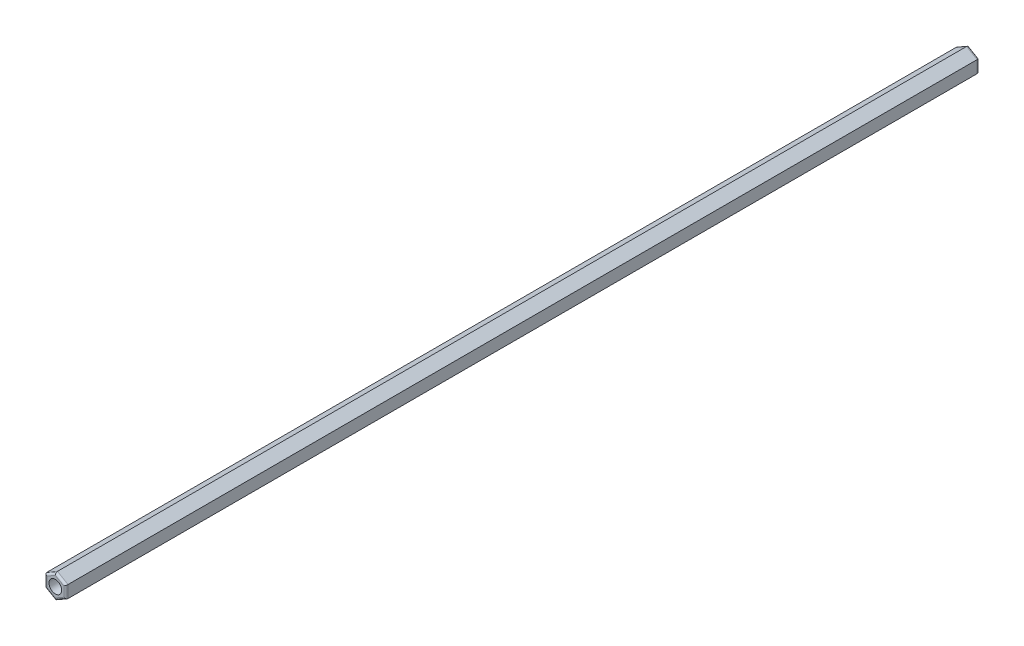
ISO-10303-21;
HEADER;
FILE_DESCRIPTION(('STEP AP214'),'2;1');
FILE_NAME('part.step','',(''),(''),'','','');
FILE_SCHEMA(('AUTOMOTIVE_DESIGN { 1 0 10303 214 1 1 1 1 }'));
ENDSEC;
DATA;
#1=APPLICATION_CONTEXT('core data for automotive mechanical design processes');
#2=APPLICATION_PROTOCOL_DEFINITION('international standard','automotive_design',2000,#1);
#3=PRODUCT_CONTEXT('',#1,'mechanical');
#4=PRODUCT('Part','Part','',(#3));
#5=PRODUCT_RELATED_PRODUCT_CATEGORY('part','',(#4));
#6=PRODUCT_DEFINITION_FORMATION('','',#4);
#7=PRODUCT_DEFINITION_CONTEXT('part definition',#1,'design');
#8=PRODUCT_DEFINITION('design','',#6,#7);
#9=PRODUCT_DEFINITION_SHAPE('','',#8);
#10=(LENGTH_UNIT() NAMED_UNIT(*) SI_UNIT(.MILLI.,.METRE.));
#11=(NAMED_UNIT(*) PLANE_ANGLE_UNIT() SI_UNIT($,.RADIAN.));
#12=(NAMED_UNIT(*) SI_UNIT($,.STERADIAN.) SOLID_ANGLE_UNIT());
#13=UNCERTAINTY_MEASURE_WITH_UNIT(LENGTH_MEASURE(1.E-05),#10,'distance_accuracy_value','');
#14=(GEOMETRIC_REPRESENTATION_CONTEXT(3) GLOBAL_UNCERTAINTY_ASSIGNED_CONTEXT((#13)) GLOBAL_UNIT_ASSIGNED_CONTEXT((#10,
#11,#12)) REPRESENTATION_CONTEXT('',''));
#15=CARTESIAN_POINT('',(0.,0.,0.));
#16=DIRECTION('',(0.,0.,1.));
#17=DIRECTION('',(1.,0.,0.));
#18=AXIS2_PLACEMENT_3D('',#15,#16,#17);
#19=CARTESIAN_POINT('',(-67.50212267549,1.44337567297406,216.));
#20=DIRECTION('',(1.,0.,0.));
#21=DIRECTION('',(0.,0.,-1.));
#22=AXIS2_PLACEMENT_3D('',#19,#20,#21);
#23=PLANE('',#22);
#24=DIRECTION('',(0.,0.,-1.));
#25=VECTOR('',#24,1.);
#26=CARTESIAN_POINT('',(-67.50212267549,-1.44337567297407,216.));
#27=LINE('',#26,#25);
#28=CARTESIAN_POINT('',(-67.50212267549,-1.44337567297407,215.5));
#29=VERTEX_POINT('',#28);
#30=CARTESIAN_POINT('',(-67.50212267549,-1.44337567297407,0.5));
#31=VERTEX_POINT('',#30);
#32=EDGE_CURVE('E153',#29,#31,#27,.T.);
#33=ORIENTED_EDGE('',*,*,#32,.T.);
#34=DIRECTION('',(0.,-1.,0.));
#35=VECTOR('',#34,1.);
#36=CARTESIAN_POINT('',(-67.50212267549,1.44337567297406,0.5));
#37=LINE('',#36,#35);
#38=CARTESIAN_POINT('',(-67.50212267549,1.44337567297406,0.5));
#39=VERTEX_POINT('',#38);
#40=EDGE_CURVE('E150',#31,#39,#37,.F.);
#41=ORIENTED_EDGE('',*,*,#40,.T.);
#42=DIRECTION('',(0.,0.,-1.));
#43=VECTOR('',#42,1.);
#44=CARTESIAN_POINT('',(-67.50212267549,1.44337567297406,216.));
#45=LINE('',#44,#43);
#46=CARTESIAN_POINT('',(-67.50212267549,1.44337567297406,215.5));
#47=VERTEX_POINT('',#46);
#48=EDGE_CURVE('E147',#47,#39,#45,.T.);
#49=ORIENTED_EDGE('',*,*,#48,.F.);
#50=DIRECTION('',(0.,-1.,0.));
#51=VECTOR('',#50,1.);
#52=CARTESIAN_POINT('',(-67.50212267549,-1.44337567297407,215.5));
#53=LINE('',#52,#51);
#54=EDGE_CURVE('E207',#47,#29,#53,.T.);
#55=ORIENTED_EDGE('',*,*,#54,.T.);
#56=EDGE_LOOP('',(#33,#41,#49,#55));
#57=FACE_BOUND('',#56,.T.);
#58=ADVANCED_FACE('F33',(#57),#23,.T.);
#59=CARTESIAN_POINT('',(-70.00212267549,2.88675134594811,216.));
#60=DIRECTION('',(0.5,0.866025403784439,0.));
#61=DIRECTION('',(-0.866025403784439,0.5,0.));
#62=AXIS2_PLACEMENT_3D('',#59,#60,#61);
#63=PLANE('',#62);
#64=ORIENTED_EDGE('',*,*,#48,.T.);
#65=DIRECTION('',(0.866025403784439,-0.5,0.));
#66=VECTOR('',#65,1.);
#67=CARTESIAN_POINT('',(-70.00212267549,2.88675134594811,0.5));
#68=LINE('',#67,#66);
#69=CARTESIAN_POINT('',(-70.00212267549,2.88675134594811,0.5));
#70=VERTEX_POINT('',#69);
#71=EDGE_CURVE('E192',#39,#70,#68,.F.);
#72=ORIENTED_EDGE('',*,*,#71,.T.);
#73=DIRECTION('',(0.,0.,-1.));
#74=VECTOR('',#73,1.);
#75=CARTESIAN_POINT('',(-70.00212267549,2.88675134594811,216.));
#76=LINE('',#75,#74);
#77=CARTESIAN_POINT('',(-70.00212267549,2.88675134594811,215.5));
#78=VERTEX_POINT('',#77);
#79=EDGE_CURVE('E256',#78,#70,#76,.T.);
#80=ORIENTED_EDGE('',*,*,#79,.F.);
#81=DIRECTION('',(0.866025403784439,-0.5,0.));
#82=VECTOR('',#81,1.);
#83=CARTESIAN_POINT('',(-67.50212267549,1.44337567297406,215.5));
#84=LINE('',#83,#82);
#85=EDGE_CURVE('E198',#78,#47,#84,.T.);
#86=ORIENTED_EDGE('',*,*,#85,.T.);
#87=EDGE_LOOP('',(#64,#72,#80,#86));
#88=FACE_BOUND('',#87,.T.);
#89=ADVANCED_FACE('F285',(#88),#63,.T.);
#90=CARTESIAN_POINT('',(-72.50212267549,1.44337567297405,216.));
#91=DIRECTION('',(-0.5,0.866025403784438,0.));
#92=DIRECTION('',(-0.866025403784439,-0.5,0.));
#93=AXIS2_PLACEMENT_3D('',#90,#91,#92);
#94=PLANE('',#93);
#95=ORIENTED_EDGE('',*,*,#79,.T.);
#96=DIRECTION('',(0.866025403784439,0.5,0.));
#97=VECTOR('',#96,1.);
#98=CARTESIAN_POINT('',(-72.50212267549,1.44337567297405,0.5));
#99=LINE('',#98,#97);
#100=CARTESIAN_POINT('',(-72.50212267549,1.44337567297405,0.5));
#101=VERTEX_POINT('',#100);
#102=EDGE_CURVE('E232',#70,#101,#99,.F.);
#103=ORIENTED_EDGE('',*,*,#102,.T.);
#104=DIRECTION('',(0.,0.,-1.));
#105=VECTOR('',#104,1.);
#106=CARTESIAN_POINT('',(-72.50212267549,1.44337567297405,216.));
#107=LINE('',#106,#105);
#108=CARTESIAN_POINT('',(-72.50212267549,1.44337567297405,215.5));
#109=VERTEX_POINT('',#108);
#110=EDGE_CURVE('E254',#109,#101,#107,.T.);
#111=ORIENTED_EDGE('',*,*,#110,.F.);
#112=DIRECTION('',(0.866025403784439,0.5,0.));
#113=VECTOR('',#112,1.);
#114=CARTESIAN_POINT('',(-70.00212267549,2.88675134594811,215.5));
#115=LINE('',#114,#113);
#116=EDGE_CURVE('E235',#109,#78,#115,.T.);
#117=ORIENTED_EDGE('',*,*,#116,.T.);
#118=EDGE_LOOP('',(#95,#103,#111,#117));
#119=FACE_BOUND('',#118,.T.);
#120=ADVANCED_FACE('F291',(#119),#94,.T.);
#121=CARTESIAN_POINT('',(-72.50212267549,-1.44337567297407,216.));
#122=DIRECTION('',(-1.,0.,0.));
#123=DIRECTION('',(0.,0.,1.));
#124=AXIS2_PLACEMENT_3D('',#121,#122,#123);
#125=PLANE('',#124);
#126=ORIENTED_EDGE('',*,*,#110,.T.);
#127=DIRECTION('',(0.,1.,0.));
#128=VECTOR('',#127,1.);
#129=CARTESIAN_POINT('',(-72.50212267549,-1.44337567297407,0.5));
#130=LINE('',#129,#128);
#131=CARTESIAN_POINT('',(-72.50212267549,-1.44337567297407,0.5));
#132=VERTEX_POINT('',#131);
#133=EDGE_CURVE('E202',#101,#132,#130,.F.);
#134=ORIENTED_EDGE('',*,*,#133,.T.);
#135=DIRECTION('',(0.,0.,-1.));
#136=VECTOR('',#135,1.);
#137=CARTESIAN_POINT('',(-72.50212267549,-1.44337567297407,216.));
#138=LINE('',#137,#136);
#139=CARTESIAN_POINT('',(-72.50212267549,-1.44337567297407,215.5));
#140=VERTEX_POINT('',#139);
#141=EDGE_CURVE('E251',#140,#132,#138,.T.);
#142=ORIENTED_EDGE('',*,*,#141,.F.);
#143=DIRECTION('',(0.,1.,0.));
#144=VECTOR('',#143,1.);
#145=CARTESIAN_POINT('',(-72.50212267549,1.44337567297405,215.5));
#146=LINE('',#145,#144);
#147=EDGE_CURVE('E227',#140,#109,#146,.T.);
#148=ORIENTED_EDGE('',*,*,#147,.T.);
#149=EDGE_LOOP('',(#126,#134,#142,#148));
#150=FACE_BOUND('',#149,.T.);
#151=ADVANCED_FACE('F342',(#150),#125,.T.);
#152=CARTESIAN_POINT('',(-70.00212267549,-2.88675134594813,216.));
#153=DIRECTION('',(-0.499999999999999,-0.866025403784439,0.));
#154=DIRECTION('',(0.866025403784439,-0.499999999999999,0.));
#155=AXIS2_PLACEMENT_3D('',#152,#153,#154);
#156=PLANE('',#155);
#157=ORIENTED_EDGE('',*,*,#141,.T.);
#158=DIRECTION('',(-0.866025403784439,0.499999999999999,0.));
#159=VECTOR('',#158,1.);
#160=CARTESIAN_POINT('',(-70.00212267549,-2.88675134594813,0.5));
#161=LINE('',#160,#159);
#162=CARTESIAN_POINT('',(-70.00212267549,-2.88675134594813,0.5));
#163=VERTEX_POINT('',#162);
#164=EDGE_CURVE('E200',#132,#163,#161,.F.);
#165=ORIENTED_EDGE('',*,*,#164,.T.);
#166=DIRECTION('',(0.,0.,-1.));
#167=VECTOR('',#166,1.);
#168=CARTESIAN_POINT('',(-70.00212267549,-2.88675134594813,216.));
#169=LINE('',#168,#167);
#170=CARTESIAN_POINT('',(-70.00212267549,-2.88675134594813,215.5));
#171=VERTEX_POINT('',#170);
#172=EDGE_CURVE('E248',#171,#163,#169,.T.);
#173=ORIENTED_EDGE('',*,*,#172,.F.);
#174=DIRECTION('',(-0.866025403784439,0.499999999999999,0.));
#175=VECTOR('',#174,1.);
#176=CARTESIAN_POINT('',(-72.50212267549,-1.44337567297407,215.5));
#177=LINE('',#176,#175);
#178=EDGE_CURVE('E197',#171,#140,#177,.T.);
#179=ORIENTED_EDGE('',*,*,#178,.T.);
#180=EDGE_LOOP('',(#157,#165,#173,#179));
#181=FACE_BOUND('',#180,.T.);
#182=ADVANCED_FACE('F281',(#181),#156,.T.);
#183=CARTESIAN_POINT('',(-67.50212267549,-1.44337567297407,216.));
#184=DIRECTION('',(0.500000000000001,-0.866025403784438,0.));
#185=DIRECTION('',(0.866025403784438,0.500000000000001,0.));
#186=AXIS2_PLACEMENT_3D('',#183,#184,#185);
#187=PLANE('',#186);
#188=ORIENTED_EDGE('',*,*,#172,.T.);
#189=DIRECTION('',(-0.866025403784438,-0.500000000000001,0.));
#190=VECTOR('',#189,1.);
#191=CARTESIAN_POINT('',(-67.50212267549,-1.44337567297407,0.5));
#192=LINE('',#191,#190);
#193=EDGE_CURVE('E212',#163,#31,#192,.F.);
#194=ORIENTED_EDGE('',*,*,#193,.T.);
#195=ORIENTED_EDGE('',*,*,#32,.F.);
#196=DIRECTION('',(-0.866025403784438,-0.500000000000001,0.));
#197=VECTOR('',#196,1.);
#198=CARTESIAN_POINT('',(-70.00212267549,-2.88675134594813,215.5));
#199=LINE('',#198,#197);
#200=EDGE_CURVE('E210',#29,#171,#199,.T.);
#201=ORIENTED_EDGE('',*,*,#200,.T.);
#202=EDGE_LOOP('',(#188,#194,#195,#201));
#203=FACE_BOUND('',#202,.T.);
#204=ADVANCED_FACE('F274',(#203),#187,.T.);
#205=CARTESIAN_POINT('',(0.,0.,216.));
#206=DIRECTION('',(0.,0.,-1.));
#207=DIRECTION('',(-1.,0.,0.));
#208=AXIS2_PLACEMENT_3D('',#205,#206,#207);
#209=PLANE('',#208);
#210=CARTESIAN_POINT('',(-70.00212267549,0.,216.));
#211=DIRECTION('',(0.,0.,1.));
#212=DIRECTION('',(1.,0.,0.));
#213=AXIS2_PLACEMENT_3D('',#210,#211,#212);
#214=CIRCLE('',#213,1.5);
#215=CARTESIAN_POINT('',(-68.50212267549,0.,216.));
#216=VERTEX_POINT('',#215);
#217=EDGE_CURVE('E259',#216,#216,#214,.T.);
#218=ORIENTED_EDGE('',*,*,#217,.F.);
#219=EDGE_LOOP('',(#218));
#220=FACE_BOUND('',#219,.T.);
#221=DIRECTION('',(0.866025403784439,-0.5,0.));
#222=VECTOR('',#221,1.);
#223=CARTESIAN_POINT('',(-70.25212267549,2.45373864405589,216.));
#224=LINE('',#223,#222);
#225=CARTESIAN_POINT('',(-68.00212267549,1.15470053837924,216.));
#226=VERTEX_POINT('',#225);
#227=CARTESIAN_POINT('',(-70.00212267549,2.30940107675849,216.));
#228=VERTEX_POINT('',#227);
#229=EDGE_CURVE('E57',#226,#228,#224,.F.);
#230=ORIENTED_EDGE('',*,*,#229,.T.);
#231=DIRECTION('',(0.866025403784439,0.5,0.));
#232=VECTOR('',#231,1.);
#233=CARTESIAN_POINT('',(-72.25212267549,1.01036297108183,216.));
#234=LINE('',#233,#232);
#235=CARTESIAN_POINT('',(-72.00212267549,1.15470053837923,216.));
#236=VERTEX_POINT('',#235);
#237=EDGE_CURVE('E11',#228,#236,#234,.F.);
#238=ORIENTED_EDGE('',*,*,#237,.T.);
#239=DIRECTION('',(0.,1.,0.));
#240=VECTOR('',#239,1.);
#241=CARTESIAN_POINT('',(-72.00212267549,-1.44337567297407,216.));
#242=LINE('',#241,#240);
#243=CARTESIAN_POINT('',(-72.00212267549,-1.15470053837925,216.));
#244=VERTEX_POINT('',#243);
#245=EDGE_CURVE('E42',#236,#244,#242,.F.);
#246=ORIENTED_EDGE('',*,*,#245,.T.);
#247=DIRECTION('',(-0.866025403784439,0.499999999999999,0.));
#248=VECTOR('',#247,1.);
#249=CARTESIAN_POINT('',(-69.75212267549,-2.45373864405591,216.));
#250=LINE('',#249,#248);
#251=CARTESIAN_POINT('',(-70.00212267549,-2.3094010767585,216.));
#252=VERTEX_POINT('',#251);
#253=EDGE_CURVE('E218',#244,#252,#250,.F.);
#254=ORIENTED_EDGE('',*,*,#253,.T.);
#255=DIRECTION('',(-0.866025403784438,-0.500000000000001,0.));
#256=VECTOR('',#255,1.);
#257=CARTESIAN_POINT('',(-67.75212267549,-1.01036297108185,216.));
#258=LINE('',#257,#256);
#259=CARTESIAN_POINT('',(-68.00212267549,-1.15470053837925,216.));
#260=VERTEX_POINT('',#259);
#261=EDGE_CURVE('E214',#252,#260,#258,.F.);
#262=ORIENTED_EDGE('',*,*,#261,.T.);
#263=DIRECTION('',(0.,-1.,0.));
#264=VECTOR('',#263,1.);
#265=CARTESIAN_POINT('',(-68.00212267549,1.44337567297406,216.));
#266=LINE('',#265,#264);
#267=EDGE_CURVE('E216',#260,#226,#266,.F.);
#268=ORIENTED_EDGE('',*,*,#267,.T.);
#269=EDGE_LOOP('',(#230,#238,#246,#254,#262,#268));
#270=FACE_BOUND('',#269,.T.);
#271=ADVANCED_FACE('F220',(#220,#270),#209,.F.);
#272=CARTESIAN_POINT('',(0.,0.,0.));
#273=DIRECTION('',(0.,0.,-1.));
#274=DIRECTION('',(-1.,0.,0.));
#275=AXIS2_PLACEMENT_3D('',#272,#273,#274);
#276=PLANE('',#275);
#277=CARTESIAN_POINT('',(-70.00212267549,0.,0.));
#278=DIRECTION('',(0.,0.,1.));
#279=DIRECTION('',(1.,0.,0.));
#280=AXIS2_PLACEMENT_3D('',#277,#278,#279);
#281=CIRCLE('',#280,1.5);
#282=CARTESIAN_POINT('',(-68.50212267549,0.,0.));
#283=VERTEX_POINT('',#282);
#284=EDGE_CURVE('E162',#283,#283,#281,.T.);
#285=ORIENTED_EDGE('',*,*,#284,.T.);
#286=EDGE_LOOP('',(#285));
#287=FACE_BOUND('',#286,.T.);
#288=DIRECTION('',(0.,1.,0.));
#289=VECTOR('',#288,1.);
#290=CARTESIAN_POINT('',(-72.00212267549,0.,0.));
#291=LINE('',#290,#289);
#292=CARTESIAN_POINT('',(-72.00212267549,-1.15470053837926,0.));
#293=VERTEX_POINT('',#292);
#294=CARTESIAN_POINT('',(-72.00212267549,1.15470053837924,0.));
#295=VERTEX_POINT('',#294);
#296=EDGE_CURVE('E242',#293,#295,#291,.T.);
#297=ORIENTED_EDGE('',*,*,#296,.T.);
#298=DIRECTION('',(0.866025403784439,0.5,0.));
#299=VECTOR('',#298,1.);
#300=CARTESIAN_POINT('',(-18.5005306688725,32.0438590854734,0.));
#301=LINE('',#300,#299);
#302=CARTESIAN_POINT('',(-70.00212267549,2.30940107675849,0.));
#303=VERTEX_POINT('',#302);
#304=EDGE_CURVE('E240',#295,#303,#301,.T.);
#305=ORIENTED_EDGE('',*,*,#304,.T.);
#306=DIRECTION('',(0.866025403784439,-0.5,0.));
#307=VECTOR('',#306,1.);
#308=CARTESIAN_POINT('',(-16.5005306688725,-28.5797574703356,0.));
#309=LINE('',#308,#307);
#310=CARTESIAN_POINT('',(-68.00212267549,1.15470053837924,0.));
#311=VERTEX_POINT('',#310);
#312=EDGE_CURVE('E131',#303,#311,#309,.T.);
#313=ORIENTED_EDGE('',*,*,#312,.T.);
#314=DIRECTION('',(0.,-1.,0.));
#315=VECTOR('',#314,1.);
#316=CARTESIAN_POINT('',(-68.00212267549,0.,0.));
#317=LINE('',#316,#315);
#318=CARTESIAN_POINT('',(-68.00212267549,-1.15470053837925,0.));
#319=VERTEX_POINT('',#318);
#320=EDGE_CURVE('E124',#311,#319,#317,.T.);
#321=ORIENTED_EDGE('',*,*,#320,.T.);
#322=DIRECTION('',(-0.866025403784438,-0.500000000000001,0.));
#323=VECTOR('',#322,1.);
#324=CARTESIAN_POINT('',(-16.5005306688726,28.5797574703357,0.));
#325=LINE('',#324,#323);
#326=CARTESIAN_POINT('',(-70.00212267549,-2.30940107675851,0.));
#327=VERTEX_POINT('',#326);
#328=EDGE_CURVE('E127',#319,#327,#325,.T.);
#329=ORIENTED_EDGE('',*,*,#328,.T.);
#330=DIRECTION('',(-0.866025403784439,0.499999999999999,0.));
#331=VECTOR('',#330,1.);
#332=CARTESIAN_POINT('',(-18.5005306688724,-32.0438590854734,0.));
#333=LINE('',#332,#331);
#334=EDGE_CURVE('E136',#327,#293,#333,.T.);
#335=ORIENTED_EDGE('',*,*,#334,.T.);
#336=EDGE_LOOP('',(#297,#305,#313,#321,#329,#335));
#337=FACE_BOUND('',#336,.T.);
#338=ADVANCED_FACE('F126',(#287,#337),#276,.T.);
#339=CARTESIAN_POINT('',(-16.5005306688726,28.5797574703357,0.5));
#340=DIRECTION('',(-0.866025403784438,-0.500000000000001,0.));
#341=DIRECTION('',(0.500000000000001,-0.866025403784438,0.));
#342=AXIS2_PLACEMENT_3D('',#339,#340,#341);
#343=CYLINDRICAL_SURFACE('',#342,0.5);
#344=CARTESIAN_POINT('',(-68.00212267549,-1.15470053837925,0.5));
#345=DIRECTION('',(-0.5,-0.866025403784439,0.));
#346=DIRECTION('',(-0.866025403784439,0.5,0.));
#347=AXIS2_PLACEMENT_3D('',#344,#345,#346);
#348=ELLIPSE('',#347,0.577350269189626,0.5);
#349=EDGE_CURVE('E142',#31,#319,#348,.F.);
#350=ORIENTED_EDGE('',*,*,#349,.F.);
#351=ORIENTED_EDGE('',*,*,#193,.F.);
#352=CARTESIAN_POINT('',(-70.00212267549,-2.3094010767585,0.5));
#353=DIRECTION('',(-1.,0.,0.));
#354=DIRECTION('',(0.,-1.,0.));
#355=AXIS2_PLACEMENT_3D('',#352,#353,#354);
#356=ELLIPSE('',#355,0.577350269189626,0.5);
#357=EDGE_CURVE('E145',#327,#163,#356,.T.);
#358=ORIENTED_EDGE('',*,*,#357,.F.);
#359=ORIENTED_EDGE('',*,*,#328,.F.);
#360=EDGE_LOOP('',(#350,#351,#358,#359));
#361=FACE_BOUND('',#360,.T.);
#362=ADVANCED_FACE('F140',(#361),#343,.T.);
#363=CARTESIAN_POINT('',(-18.5005306688724,-32.0438590854734,0.5));
#364=DIRECTION('',(-0.866025403784439,0.499999999999999,0.));
#365=DIRECTION('',(-0.499999999999999,-0.866025403784439,0.));
#366=AXIS2_PLACEMENT_3D('',#363,#364,#365);
#367=CYLINDRICAL_SURFACE('',#366,0.5);
#368=ORIENTED_EDGE('',*,*,#357,.T.);
#369=ORIENTED_EDGE('',*,*,#164,.F.);
#370=CARTESIAN_POINT('',(-72.00212267549,-1.15470053837926,0.5));
#371=DIRECTION('',(-0.500000000000001,0.866025403784438,0.));
#372=DIRECTION('',(-0.866025403784438,-0.500000000000001,0.));
#373=AXIS2_PLACEMENT_3D('',#370,#371,#372);
#374=ELLIPSE('',#373,0.577350269189626,0.5);
#375=EDGE_CURVE('E151',#293,#132,#374,.T.);
#376=ORIENTED_EDGE('',*,*,#375,.F.);
#377=ORIENTED_EDGE('',*,*,#334,.F.);
#378=EDGE_LOOP('',(#368,#369,#376,#377));
#379=FACE_BOUND('',#378,.T.);
#380=ADVANCED_FACE('F306',(#379),#367,.T.);
#381=CARTESIAN_POINT('',(-68.00212267549,0.,0.5));
#382=DIRECTION('',(0.,-1.,0.));
#383=DIRECTION('',(0.,0.,-1.));
#384=AXIS2_PLACEMENT_3D('',#381,#382,#383);
#385=CYLINDRICAL_SURFACE('',#384,0.5);
#386=ORIENTED_EDGE('',*,*,#349,.T.);
#387=ORIENTED_EDGE('',*,*,#320,.F.);
#388=CARTESIAN_POINT('',(-68.00212267549,1.15470053837924,0.5));
#389=DIRECTION('',(0.5,-0.866025403784439,0.));
#390=DIRECTION('',(-0.866025403784439,-0.5,0.));
#391=AXIS2_PLACEMENT_3D('',#388,#389,#390);
#392=ELLIPSE('',#391,0.577350269189626,0.5);
#393=EDGE_CURVE('E156',#39,#311,#392,.F.);
#394=ORIENTED_EDGE('',*,*,#393,.F.);
#395=ORIENTED_EDGE('',*,*,#40,.F.);
#396=EDGE_LOOP('',(#386,#387,#394,#395));
#397=FACE_BOUND('',#396,.T.);
#398=ADVANCED_FACE('F149',(#397),#385,.T.);
#399=CARTESIAN_POINT('',(-72.00212267549,0.,0.5));
#400=DIRECTION('',(0.,1.,0.));
#401=DIRECTION('',(0.,0.,1.));
#402=AXIS2_PLACEMENT_3D('',#399,#400,#401);
#403=CYLINDRICAL_SURFACE('',#402,0.5);
#404=ORIENTED_EDGE('',*,*,#375,.T.);
#405=ORIENTED_EDGE('',*,*,#133,.F.);
#406=CARTESIAN_POINT('',(-72.00212267549,1.15470053837923,0.5));
#407=DIRECTION('',(0.5,0.866025403784439,0.));
#408=DIRECTION('',(-0.866025403784439,0.5,0.));
#409=AXIS2_PLACEMENT_3D('',#406,#407,#408);
#410=ELLIPSE('',#409,0.577350269189626,0.5);
#411=EDGE_CURVE('E181',#295,#101,#410,.T.);
#412=ORIENTED_EDGE('',*,*,#411,.F.);
#413=ORIENTED_EDGE('',*,*,#296,.F.);
#414=EDGE_LOOP('',(#404,#405,#412,#413));
#415=FACE_BOUND('',#414,.T.);
#416=ADVANCED_FACE('F300',(#415),#403,.T.);
#417=CARTESIAN_POINT('',(-16.5005306688725,-28.5797574703356,0.5));
#418=DIRECTION('',(0.866025403784439,-0.5,0.));
#419=DIRECTION('',(0.5,0.866025403784439,0.));
#420=AXIS2_PLACEMENT_3D('',#417,#418,#419);
#421=CYLINDRICAL_SURFACE('',#420,0.5);
#422=ORIENTED_EDGE('',*,*,#393,.T.);
#423=ORIENTED_EDGE('',*,*,#312,.F.);
#424=CARTESIAN_POINT('',(-70.00212267549,2.30940107675848,0.5));
#425=DIRECTION('',(1.,0.,0.));
#426=DIRECTION('',(0.,-1.,0.));
#427=AXIS2_PLACEMENT_3D('',#424,#425,#426);
#428=ELLIPSE('',#427,0.577350269189626,0.5);
#429=EDGE_CURVE('E176',#70,#303,#428,.F.);
#430=ORIENTED_EDGE('',*,*,#429,.F.);
#431=ORIENTED_EDGE('',*,*,#71,.F.);
#432=EDGE_LOOP('',(#422,#423,#430,#431));
#433=FACE_BOUND('',#432,.T.);
#434=ADVANCED_FACE('F191',(#433),#421,.T.);
#435=CARTESIAN_POINT('',(-18.5005306688725,32.0438590854734,0.5));
#436=DIRECTION('',(0.866025403784439,0.5,0.));
#437=DIRECTION('',(-0.5,0.866025403784438,0.));
#438=AXIS2_PLACEMENT_3D('',#435,#436,#437);
#439=CYLINDRICAL_SURFACE('',#438,0.5);
#440=ORIENTED_EDGE('',*,*,#411,.T.);
#441=ORIENTED_EDGE('',*,*,#102,.F.);
#442=ORIENTED_EDGE('',*,*,#429,.T.);
#443=ORIENTED_EDGE('',*,*,#304,.F.);
#444=EDGE_LOOP('',(#440,#441,#442,#443));
#445=FACE_BOUND('',#444,.T.);
#446=ADVANCED_FACE('F295',(#445),#439,.T.);
#447=CARTESIAN_POINT('',(-67.75212267549,-1.01036297108185,215.5));
#448=DIRECTION('',(0.866025403784438,0.500000000000001,0.));
#449=DIRECTION('',(-0.500000000000001,0.866025403784438,0.));
#450=AXIS2_PLACEMENT_3D('',#447,#448,#449);
#451=CYLINDRICAL_SURFACE('',#450,0.5);
#452=CARTESIAN_POINT('',(-68.00212267549,-1.15470053837926,215.5));
#453=DIRECTION('',(0.5,0.866025403784439,0.));
#454=DIRECTION('',(0.866025403784439,-0.5,0.));
#455=AXIS2_PLACEMENT_3D('',#452,#453,#454);
#456=ELLIPSE('',#455,0.577350269189626,0.5);
#457=EDGE_CURVE('E169',#260,#29,#456,.T.);
#458=ORIENTED_EDGE('',*,*,#457,.F.);
#459=ORIENTED_EDGE('',*,*,#261,.F.);
#460=CARTESIAN_POINT('',(-70.00212267549,-2.3094010767585,215.5));
#461=DIRECTION('',(1.,0.,0.));
#462=DIRECTION('',(0.,1.,0.));
#463=AXIS2_PLACEMENT_3D('',#460,#461,#462);
#464=ELLIPSE('',#463,0.577350269189626,0.5);
#465=EDGE_CURVE('E37',#171,#252,#464,.F.);
#466=ORIENTED_EDGE('',*,*,#465,.F.);
#467=ORIENTED_EDGE('',*,*,#200,.F.);
#468=EDGE_LOOP('',(#458,#459,#466,#467));
#469=FACE_BOUND('',#468,.T.);
#470=ADVANCED_FACE('F35',(#469),#451,.T.);
#471=CARTESIAN_POINT('',(-69.75212267549,-2.45373864405591,215.5));
#472=DIRECTION('',(0.866025403784439,-0.499999999999999,0.));
#473=DIRECTION('',(0.499999999999999,0.866025403784439,0.));
#474=AXIS2_PLACEMENT_3D('',#471,#472,#473);
#475=CYLINDRICAL_SURFACE('',#474,0.5);
#476=ORIENTED_EDGE('',*,*,#465,.T.);
#477=ORIENTED_EDGE('',*,*,#253,.F.);
#478=CARTESIAN_POINT('',(-72.00212267549,-1.15470053837925,215.5));
#479=DIRECTION('',(0.500000000000001,-0.866025403784438,0.));
#480=DIRECTION('',(0.866025403784438,0.500000000000001,0.));
#481=AXIS2_PLACEMENT_3D('',#478,#479,#480);
#482=ELLIPSE('',#481,0.577350269189626,0.5);
#483=EDGE_CURVE('E167',#140,#244,#482,.F.);
#484=ORIENTED_EDGE('',*,*,#483,.F.);
#485=ORIENTED_EDGE('',*,*,#178,.F.);
#486=EDGE_LOOP('',(#476,#477,#484,#485));
#487=FACE_BOUND('',#486,.T.);
#488=ADVANCED_FACE('F224',(#487),#475,.T.);
#489=CARTESIAN_POINT('',(-68.00212267549,1.44337567297406,215.5));
#490=DIRECTION('',(0.,1.,0.));
#491=DIRECTION('',(0.,0.,1.));
#492=AXIS2_PLACEMENT_3D('',#489,#490,#491);
#493=CYLINDRICAL_SURFACE('',#492,0.5);
#494=ORIENTED_EDGE('',*,*,#457,.T.);
#495=ORIENTED_EDGE('',*,*,#54,.F.);
#496=CARTESIAN_POINT('',(-68.00212267549,1.15470053837924,215.5));
#497=DIRECTION('',(-0.5,0.866025403784439,0.));
#498=DIRECTION('',(0.866025403784439,0.5,0.));
#499=AXIS2_PLACEMENT_3D('',#496,#497,#498);
#500=ELLIPSE('',#499,0.577350269189626,0.5);
#501=EDGE_CURVE('E164',#226,#47,#500,.T.);
#502=ORIENTED_EDGE('',*,*,#501,.F.);
#503=ORIENTED_EDGE('',*,*,#267,.F.);
#504=EDGE_LOOP('',(#494,#495,#502,#503));
#505=FACE_BOUND('',#504,.T.);
#506=ADVANCED_FACE('F320',(#505),#493,.T.);
#507=CARTESIAN_POINT('',(-72.00212267549,-1.44337567297407,215.5));
#508=DIRECTION('',(0.,-1.,0.));
#509=DIRECTION('',(0.,0.,-1.));
#510=AXIS2_PLACEMENT_3D('',#507,#508,#509);
#511=CYLINDRICAL_SURFACE('',#510,0.5);
#512=ORIENTED_EDGE('',*,*,#483,.T.);
#513=ORIENTED_EDGE('',*,*,#245,.F.);
#514=CARTESIAN_POINT('',(-72.00212267549,1.15470053837923,215.5));
#515=DIRECTION('',(-0.5,-0.866025403784439,0.));
#516=DIRECTION('',(0.866025403784439,-0.5,0.));
#517=AXIS2_PLACEMENT_3D('',#514,#515,#516);
#518=ELLIPSE('',#517,0.577350269189626,0.5);
#519=EDGE_CURVE('E50',#109,#236,#518,.F.);
#520=ORIENTED_EDGE('',*,*,#519,.F.);
#521=ORIENTED_EDGE('',*,*,#147,.F.);
#522=EDGE_LOOP('',(#512,#513,#520,#521));
#523=FACE_BOUND('',#522,.T.);
#524=ADVANCED_FACE('F226',(#523),#511,.T.);
#525=CARTESIAN_POINT('',(-70.25212267549,2.45373864405589,215.5));
#526=DIRECTION('',(-0.866025403784439,0.5,0.));
#527=DIRECTION('',(-0.5,-0.866025403784439,0.));
#528=AXIS2_PLACEMENT_3D('',#525,#526,#527);
#529=CYLINDRICAL_SURFACE('',#528,0.5);
#530=ORIENTED_EDGE('',*,*,#501,.T.);
#531=ORIENTED_EDGE('',*,*,#85,.F.);
#532=CARTESIAN_POINT('',(-70.00212267549,2.30940107675849,215.5));
#533=DIRECTION('',(-1.,0.,0.));
#534=DIRECTION('',(0.,1.,0.));
#535=AXIS2_PLACEMENT_3D('',#532,#533,#534);
#536=ELLIPSE('',#535,0.577350269189626,0.5);
#537=EDGE_CURVE('E160',#228,#78,#536,.T.);
#538=ORIENTED_EDGE('',*,*,#537,.F.);
#539=ORIENTED_EDGE('',*,*,#229,.F.);
#540=EDGE_LOOP('',(#530,#531,#538,#539));
#541=FACE_BOUND('',#540,.T.);
#542=ADVANCED_FACE('F314',(#541),#529,.T.);
#543=CARTESIAN_POINT('',(-72.25212267549,1.01036297108183,215.5));
#544=DIRECTION('',(-0.866025403784439,-0.5,0.));
#545=DIRECTION('',(0.5,-0.866025403784438,0.));
#546=AXIS2_PLACEMENT_3D('',#543,#544,#545);
#547=CYLINDRICAL_SURFACE('',#546,0.5);
#548=ORIENTED_EDGE('',*,*,#519,.T.);
#549=ORIENTED_EDGE('',*,*,#237,.F.);
#550=ORIENTED_EDGE('',*,*,#537,.T.);
#551=ORIENTED_EDGE('',*,*,#116,.F.);
#552=EDGE_LOOP('',(#548,#549,#550,#551));
#553=FACE_BOUND('',#552,.T.);
#554=ADVANCED_FACE('F269',(#553),#547,.T.);
#555=CARTESIAN_POINT('',(-70.00212267549,0.,0.));
#556=DIRECTION('',(0.,0.,1.));
#557=DIRECTION('',(1.,0.,0.));
#558=AXIS2_PLACEMENT_3D('',#555,#556,#557);
#559=CYLINDRICAL_SURFACE('',#558,1.5);
#560=ORIENTED_EDGE('',*,*,#284,.F.);
#561=EDGE_LOOP('',(#560));
#562=FACE_BOUND('',#561,.T.);
#563=ORIENTED_EDGE('',*,*,#217,.T.);
#564=EDGE_LOOP('',(#563));
#565=FACE_BOUND('',#564,.T.);
#566=ADVANCED_FACE('F266',(#562,#565),#559,.F.);
#567=CLOSED_SHELL('',(#58,#89,#120,#151,#182,#204,#271,#338,#362,#380,#398,#416,#434,#446,#470,
#488,#506,#524,#542,#554,#566));
#568=MANIFOLD_SOLID_BREP('B2',#567);
#569=ADVANCED_BREP_SHAPE_REPRESENTATION('',(#18,#568),#14);
#570=SHAPE_DEFINITION_REPRESENTATION(#9,#569);
ENDSEC;
END-ISO-10303-21;
